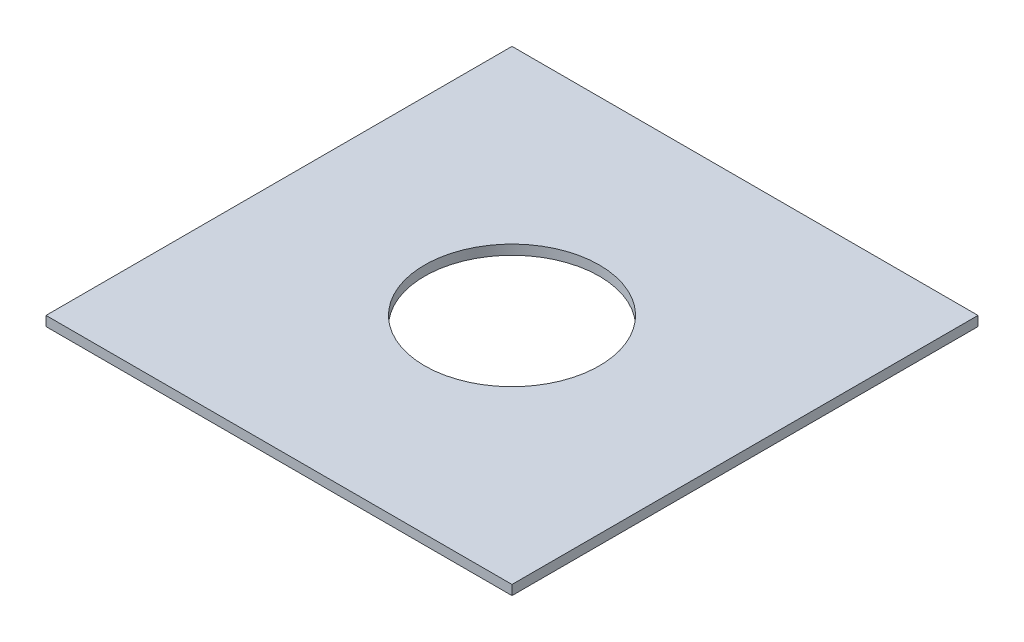
ISO-10303-21;
HEADER;
FILE_DESCRIPTION(('STEP AP214'),'2;1');
FILE_NAME('part.step','',(''),(''),'','','');
FILE_SCHEMA(('AUTOMOTIVE_DESIGN { 1 0 10303 214 1 1 1 1 }'));
ENDSEC;
DATA;
#1=APPLICATION_CONTEXT('core data for automotive mechanical design processes');
#2=APPLICATION_PROTOCOL_DEFINITION('international standard','automotive_design',2000,#1);
#3=PRODUCT_CONTEXT('',#1,'mechanical');
#4=PRODUCT('Part','Part','',(#3));
#5=PRODUCT_RELATED_PRODUCT_CATEGORY('part','',(#4));
#6=PRODUCT_DEFINITION_FORMATION('','',#4);
#7=PRODUCT_DEFINITION_CONTEXT('part definition',#1,'design');
#8=PRODUCT_DEFINITION('design','',#6,#7);
#9=PRODUCT_DEFINITION_SHAPE('','',#8);
#10=(LENGTH_UNIT() NAMED_UNIT(*) SI_UNIT(.MILLI.,.METRE.));
#11=(NAMED_UNIT(*) PLANE_ANGLE_UNIT() SI_UNIT($,.RADIAN.));
#12=(NAMED_UNIT(*) SI_UNIT($,.STERADIAN.) SOLID_ANGLE_UNIT());
#13=UNCERTAINTY_MEASURE_WITH_UNIT(LENGTH_MEASURE(1.E-05),#10,'distance_accuracy_value','');
#14=(GEOMETRIC_REPRESENTATION_CONTEXT(3) GLOBAL_UNCERTAINTY_ASSIGNED_CONTEXT((#13)) GLOBAL_UNIT_ASSIGNED_CONTEXT((#10,
#11,#12)) REPRESENTATION_CONTEXT('',''));
#15=CARTESIAN_POINT('',(0.,0.,0.));
#16=DIRECTION('',(0.,0.,1.));
#17=DIRECTION('',(1.,0.,0.));
#18=AXIS2_PLACEMENT_3D('',#15,#16,#17);
#19=CARTESIAN_POINT('',(-152.4,6.35,-304.8));
#20=DIRECTION('',(1.,0.,0.));
#21=DIRECTION('',(0.,0.,-1.));
#22=AXIS2_PLACEMENT_3D('',#19,#20,#21);
#23=PLANE('',#22);
#24=DIRECTION('',(0.,0.,1.));
#25=VECTOR('',#24,1.);
#26=CARTESIAN_POINT('',(-152.4,0.,-304.8));
#27=LINE('',#26,#25);
#28=CARTESIAN_POINT('',(-152.4,0.,-304.8));
#29=VERTEX_POINT('',#28);
#30=CARTESIAN_POINT('',(-152.4,0.,0.));
#31=VERTEX_POINT('',#30);
#32=EDGE_CURVE('E96',#29,#31,#27,.T.);
#33=ORIENTED_EDGE('',*,*,#32,.T.);
#34=DIRECTION('',(0.,-1.,0.));
#35=VECTOR('',#34,1.);
#36=CARTESIAN_POINT('',(-152.4,6.35,0.));
#37=LINE('',#36,#35);
#38=CARTESIAN_POINT('',(-152.4,6.35,0.));
#39=VERTEX_POINT('',#38);
#40=EDGE_CURVE('E11',#39,#31,#37,.T.);
#41=ORIENTED_EDGE('',*,*,#40,.F.);
#42=DIRECTION('',(0.,0.,1.));
#43=VECTOR('',#42,1.);
#44=CARTESIAN_POINT('',(-152.4,6.35,-304.8));
#45=LINE('',#44,#43);
#46=CARTESIAN_POINT('',(-152.4,6.35,-304.8));
#47=VERTEX_POINT('',#46);
#48=EDGE_CURVE('E84',#47,#39,#45,.T.);
#49=ORIENTED_EDGE('',*,*,#48,.F.);
#50=DIRECTION('',(0.,-1.,0.));
#51=VECTOR('',#50,1.);
#52=CARTESIAN_POINT('',(-152.4,6.35,-304.8));
#53=LINE('',#52,#51);
#54=EDGE_CURVE('E92',#47,#29,#53,.T.);
#55=ORIENTED_EDGE('',*,*,#54,.T.);
#56=EDGE_LOOP('',(#33,#41,#49,#55));
#57=FACE_BOUND('',#56,.T.);
#58=ADVANCED_FACE('F33',(#57),#23,.F.);
#59=CARTESIAN_POINT('',(-152.4,6.35,0.));
#60=DIRECTION('',(0.,0.,-1.));
#61=DIRECTION('',(-1.,0.,0.));
#62=AXIS2_PLACEMENT_3D('',#59,#60,#61);
#63=PLANE('',#62);
#64=DIRECTION('',(1.,0.,0.));
#65=VECTOR('',#64,1.);
#66=CARTESIAN_POINT('',(-152.4,0.,0.));
#67=LINE('',#66,#65);
#68=CARTESIAN_POINT('',(152.4,0.,0.));
#69=VERTEX_POINT('',#68);
#70=EDGE_CURVE('E88',#31,#69,#67,.T.);
#71=ORIENTED_EDGE('',*,*,#70,.T.);
#72=DIRECTION('',(0.,-1.,0.));
#73=VECTOR('',#72,1.);
#74=CARTESIAN_POINT('',(152.4,6.35,0.));
#75=LINE('',#74,#73);
#76=CARTESIAN_POINT('',(152.4,6.35,0.));
#77=VERTEX_POINT('',#76);
#78=EDGE_CURVE('E41',#77,#69,#75,.T.);
#79=ORIENTED_EDGE('',*,*,#78,.F.);
#80=DIRECTION('',(1.,0.,0.));
#81=VECTOR('',#80,1.);
#82=CARTESIAN_POINT('',(-152.4,6.35,0.));
#83=LINE('',#82,#81);
#84=EDGE_CURVE('E79',#39,#77,#83,.T.);
#85=ORIENTED_EDGE('',*,*,#84,.F.);
#86=ORIENTED_EDGE('',*,*,#40,.T.);
#87=EDGE_LOOP('',(#71,#79,#85,#86));
#88=FACE_BOUND('',#87,.T.);
#89=ADVANCED_FACE('F87',(#88),#63,.F.);
#90=CARTESIAN_POINT('',(152.4,6.35,-304.8));
#91=DIRECTION('',(-1.,0.,0.));
#92=DIRECTION('',(0.,0.,1.));
#93=AXIS2_PLACEMENT_3D('',#90,#91,#92);
#94=PLANE('',#93);
#95=DIRECTION('',(0.,0.,-1.));
#96=VECTOR('',#95,1.);
#97=CARTESIAN_POINT('',(152.4,0.,-304.8));
#98=LINE('',#97,#96);
#99=CARTESIAN_POINT('',(152.4,0.,-304.8));
#100=VERTEX_POINT('',#99);
#101=EDGE_CURVE('E66',#69,#100,#98,.T.);
#102=ORIENTED_EDGE('',*,*,#101,.T.);
#103=DIRECTION('',(0.,-1.,0.));
#104=VECTOR('',#103,1.);
#105=CARTESIAN_POINT('',(152.4,6.35,-304.8));
#106=LINE('',#105,#104);
#107=CARTESIAN_POINT('',(152.4,6.35,-304.8));
#108=VERTEX_POINT('',#107);
#109=EDGE_CURVE('E89',#108,#100,#106,.T.);
#110=ORIENTED_EDGE('',*,*,#109,.F.);
#111=DIRECTION('',(0.,0.,-1.));
#112=VECTOR('',#111,1.);
#113=CARTESIAN_POINT('',(152.4,6.35,-304.8));
#114=LINE('',#113,#112);
#115=EDGE_CURVE('E82',#77,#108,#114,.T.);
#116=ORIENTED_EDGE('',*,*,#115,.F.);
#117=ORIENTED_EDGE('',*,*,#78,.T.);
#118=EDGE_LOOP('',(#102,#110,#116,#117));
#119=FACE_BOUND('',#118,.T.);
#120=ADVANCED_FACE('F90',(#119),#94,.F.);
#121=CARTESIAN_POINT('',(-152.4,6.35,-304.8));
#122=DIRECTION('',(0.,0.,1.));
#123=DIRECTION('',(1.,0.,0.));
#124=AXIS2_PLACEMENT_3D('',#121,#122,#123);
#125=PLANE('',#124);
#126=DIRECTION('',(-1.,0.,0.));
#127=VECTOR('',#126,1.);
#128=CARTESIAN_POINT('',(-152.4,0.,-304.8));
#129=LINE('',#128,#127);
#130=EDGE_CURVE('E72',#100,#29,#129,.T.);
#131=ORIENTED_EDGE('',*,*,#130,.T.);
#132=ORIENTED_EDGE('',*,*,#54,.F.);
#133=DIRECTION('',(-1.,0.,0.));
#134=VECTOR('',#133,1.);
#135=CARTESIAN_POINT('',(-152.4,6.35,-304.8));
#136=LINE('',#135,#134);
#137=EDGE_CURVE('E49',#108,#47,#136,.T.);
#138=ORIENTED_EDGE('',*,*,#137,.F.);
#139=ORIENTED_EDGE('',*,*,#109,.T.);
#140=EDGE_LOOP('',(#131,#132,#138,#139));
#141=FACE_BOUND('',#140,.T.);
#142=ADVANCED_FACE('F104',(#141),#125,.F.);
#143=CARTESIAN_POINT('',(0.,6.35,0.));
#144=DIRECTION('',(0.,1.,0.));
#145=DIRECTION('',(0.,0.,1.));
#146=AXIS2_PLACEMENT_3D('',#143,#144,#145);
#147=PLANE('',#146);
#148=CARTESIAN_POINT('',(0.,6.35,-152.4));
#149=DIRECTION('',(0.,1.,0.));
#150=DIRECTION('',(0.,0.,1.));
#151=AXIS2_PLACEMENT_3D('',#148,#149,#150);
#152=CIRCLE('',#151,57.15);
#153=CARTESIAN_POINT('',(0.,6.35,-95.25));
#154=VERTEX_POINT('',#153);
#155=EDGE_CURVE('E112',#154,#154,#152,.T.);
#156=ORIENTED_EDGE('',*,*,#155,.F.);
#157=EDGE_LOOP('',(#156));
#158=FACE_BOUND('',#157,.T.);
#159=ORIENTED_EDGE('',*,*,#48,.T.);
#160=ORIENTED_EDGE('',*,*,#84,.T.);
#161=ORIENTED_EDGE('',*,*,#115,.T.);
#162=ORIENTED_EDGE('',*,*,#137,.T.);
#163=EDGE_LOOP('',(#159,#160,#161,#162));
#164=FACE_BOUND('',#163,.T.);
#165=ADVANCED_FACE('F80',(#158,#164),#147,.T.);
#166=CARTESIAN_POINT('',(0.,0.,0.));
#167=DIRECTION('',(0.,1.,0.));
#168=DIRECTION('',(0.,0.,1.));
#169=AXIS2_PLACEMENT_3D('',#166,#167,#168);
#170=PLANE('',#169);
#171=CARTESIAN_POINT('',(0.,0.,-152.4));
#172=DIRECTION('',(0.,1.,0.));
#173=DIRECTION('',(0.,0.,1.));
#174=AXIS2_PLACEMENT_3D('',#171,#172,#173);
#175=CIRCLE('',#174,57.15);
#176=CARTESIAN_POINT('',(0.,0.,-95.25));
#177=VERTEX_POINT('',#176);
#178=EDGE_CURVE('E99',#177,#177,#175,.F.);
#179=ORIENTED_EDGE('',*,*,#178,.F.);
#180=EDGE_LOOP('',(#179));
#181=FACE_BOUND('',#180,.T.);
#182=ORIENTED_EDGE('',*,*,#32,.F.);
#183=ORIENTED_EDGE('',*,*,#130,.F.);
#184=ORIENTED_EDGE('',*,*,#101,.F.);
#185=ORIENTED_EDGE('',*,*,#70,.F.);
#186=EDGE_LOOP('',(#182,#183,#184,#185));
#187=FACE_BOUND('',#186,.T.);
#188=ADVANCED_FACE('F107',(#181,#187),#170,.F.);
#189=CARTESIAN_POINT('',(0.,-0.00100000000000013,-152.4));
#190=DIRECTION('',(0.,1.,0.));
#191=DIRECTION('',(0.,0.,1.));
#192=AXIS2_PLACEMENT_3D('',#189,#190,#191);
#193=CYLINDRICAL_SURFACE('',#192,57.15);
#194=ORIENTED_EDGE('',*,*,#155,.T.);
#195=EDGE_LOOP('',(#194));
#196=FACE_BOUND('',#195,.T.);
#197=ORIENTED_EDGE('',*,*,#178,.T.);
#198=EDGE_LOOP('',(#197));
#199=FACE_BOUND('',#198,.T.);
#200=ADVANCED_FACE('F116',(#196,#199),#193,.F.);
#201=CLOSED_SHELL('',(#58,#89,#120,#142,#165,#188,#200));
#202=MANIFOLD_SOLID_BREP('B2',#201);
#203=ADVANCED_BREP_SHAPE_REPRESENTATION('',(#18,#202),#14);
#204=SHAPE_DEFINITION_REPRESENTATION(#9,#203);
ENDSEC;
END-ISO-10303-21;
